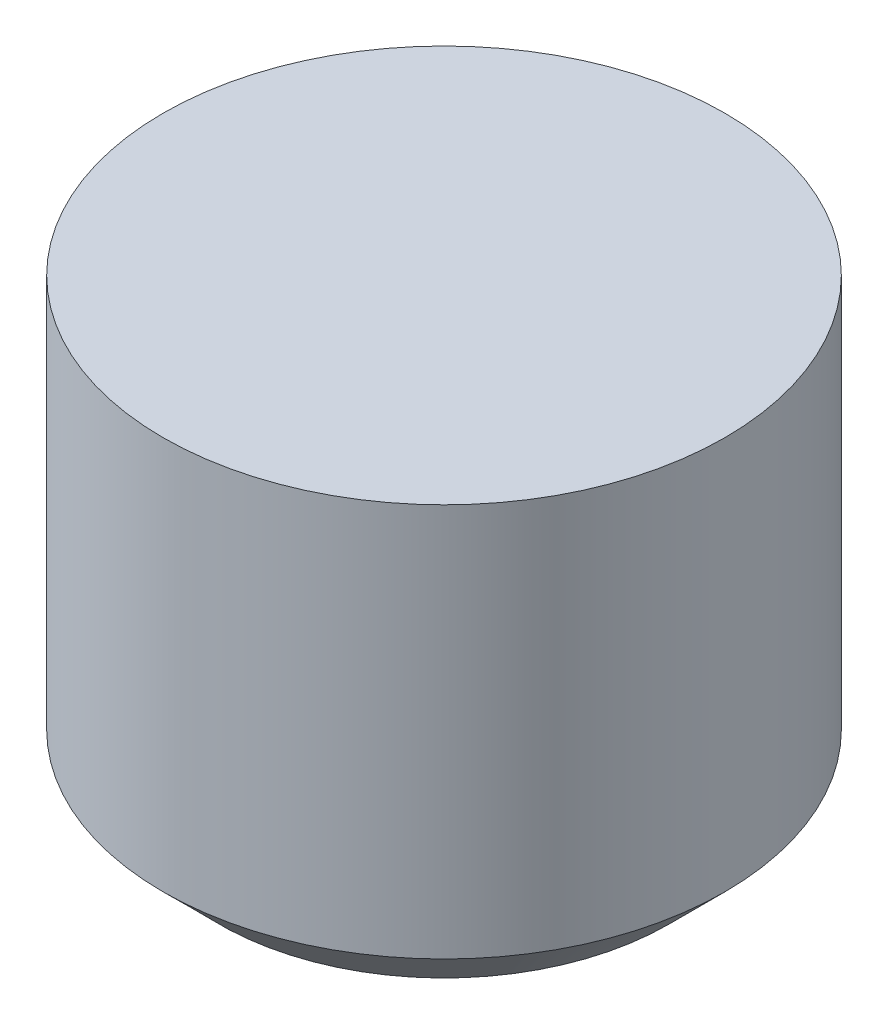
ISO-10303-21;
HEADER;
FILE_DESCRIPTION(('STEP AP214'),'2;1');
FILE_NAME('part.step','',(''),(''),'','','');
FILE_SCHEMA(('AUTOMOTIVE_DESIGN { 1 0 10303 214 1 1 1 1 }'));
ENDSEC;
DATA;
#1=APPLICATION_CONTEXT('core data for automotive mechanical design processes');
#2=APPLICATION_PROTOCOL_DEFINITION('international standard','automotive_design',2000,#1);
#3=PRODUCT_CONTEXT('',#1,'mechanical');
#4=PRODUCT('Part','Part','',(#3));
#5=PRODUCT_RELATED_PRODUCT_CATEGORY('part','',(#4));
#6=PRODUCT_DEFINITION_FORMATION('','',#4);
#7=PRODUCT_DEFINITION_CONTEXT('part definition',#1,'design');
#8=PRODUCT_DEFINITION('design','',#6,#7);
#9=PRODUCT_DEFINITION_SHAPE('','',#8);
#10=(LENGTH_UNIT() NAMED_UNIT(*) SI_UNIT(.MILLI.,.METRE.));
#11=(NAMED_UNIT(*) PLANE_ANGLE_UNIT() SI_UNIT($,.RADIAN.));
#12=(NAMED_UNIT(*) SI_UNIT($,.STERADIAN.) SOLID_ANGLE_UNIT());
#13=UNCERTAINTY_MEASURE_WITH_UNIT(LENGTH_MEASURE(1.E-05),#10,'distance_accuracy_value','');
#14=(GEOMETRIC_REPRESENTATION_CONTEXT(3) GLOBAL_UNCERTAINTY_ASSIGNED_CONTEXT((#13)) GLOBAL_UNIT_ASSIGNED_CONTEXT((#10,
#11,#12)) REPRESENTATION_CONTEXT('',''));
#15=CARTESIAN_POINT('',(0.,0.,0.));
#16=DIRECTION('',(0.,0.,1.));
#17=DIRECTION('',(1.,0.,0.));
#18=AXIS2_PLACEMENT_3D('',#15,#16,#17);
#19=CARTESIAN_POINT('',(0.,-2.,0.));
#20=DIRECTION('',(0.,1.,0.));
#21=DIRECTION('',(0.,0.,1.));
#22=AXIS2_PLACEMENT_3D('',#19,#20,#21);
#23=PLANE('',#22);
#24=CARTESIAN_POINT('',(0.,-1.99999999995271,0.));
#25=DIRECTION('',(0.,1.,0.));
#26=DIRECTION('',(-1.,0.,0.));
#27=AXIS2_PLACEMENT_3D('',#24,#25,#26);
#28=CIRCLE('',#27,2.00000000000955);
#29=CARTESIAN_POINT('',(-2.00000000000955,-1.99999999995271,0.));
#30=VERTEX_POINT('',#29);
#31=EDGE_CURVE('E17',#30,#30,#28,.T.);
#32=ORIENTED_EDGE('',*,*,#31,.F.);
#33=EDGE_LOOP('',(#32));
#34=FACE_BOUND('',#33,.T.);
#35=ADVANCED_FACE('F14',(#34),#23,.F.);
#36=CARTESIAN_POINT('',(0.,-1.50000000002137,0.));
#37=DIRECTION('',(0.,1.,0.));
#38=DIRECTION('',(-1.,0.,0.));
#39=AXIS2_PLACEMENT_3D('',#36,#37,#38);
#40=CONICAL_SURFACE('',#39,2.49999999994088,0.785398163397448);
#41=ORIENTED_EDGE('',*,*,#31,.T.);
#42=EDGE_LOOP('',(#41));
#43=FACE_BOUND('',#42,.T.);
#44=CARTESIAN_POINT('',(0.,-1.5,0.));
#45=DIRECTION('',(0.,-1.,0.));
#46=DIRECTION('',(0.,0.,-1.));
#47=AXIS2_PLACEMENT_3D('',#44,#45,#46);
#48=CIRCLE('',#47,2.5);
#49=CARTESIAN_POINT('',(0.,-1.5,-2.5));
#50=VERTEX_POINT('',#49);
#51=EDGE_CURVE('E21',#50,#50,#48,.F.);
#52=ORIENTED_EDGE('',*,*,#51,.F.);
#53=EDGE_LOOP('',(#52));
#54=FACE_BOUND('',#53,.T.);
#55=ADVANCED_FACE('F31',(#43,#54),#40,.T.);
#56=CARTESIAN_POINT('',(0.,2.,0.));
#57=DIRECTION('',(0.,1.,0.));
#58=DIRECTION('',(0.,0.,1.));
#59=AXIS2_PLACEMENT_3D('',#56,#57,#58);
#60=PLANE('',#59);
#61=CARTESIAN_POINT('',(0.,2.,0.));
#62=DIRECTION('',(0.,-1.,0.));
#63=DIRECTION('',(0.,0.,-1.));
#64=AXIS2_PLACEMENT_3D('',#61,#62,#63);
#65=CIRCLE('',#64,2.5);
#66=CARTESIAN_POINT('',(0.,2.,-2.5));
#67=VERTEX_POINT('',#66);
#68=EDGE_CURVE('E10',#67,#67,#65,.T.);
#69=ORIENTED_EDGE('',*,*,#68,.F.);
#70=EDGE_LOOP('',(#69));
#71=FACE_BOUND('',#70,.T.);
#72=ADVANCED_FACE('F39',(#71),#60,.T.);
#73=CARTESIAN_POINT('',(0.,2.,0.));
#74=DIRECTION('',(0.,-1.,0.));
#75=DIRECTION('',(0.,0.,-1.));
#76=AXIS2_PLACEMENT_3D('',#73,#74,#75);
#77=CYLINDRICAL_SURFACE('',#76,2.5);
#78=ORIENTED_EDGE('',*,*,#68,.T.);
#79=EDGE_LOOP('',(#78));
#80=FACE_BOUND('',#79,.T.);
#81=ORIENTED_EDGE('',*,*,#51,.T.);
#82=EDGE_LOOP('',(#81));
#83=FACE_BOUND('',#82,.T.);
#84=ADVANCED_FACE('F40',(#80,#83),#77,.T.);
#85=CLOSED_SHELL('',(#35,#55,#72,#84));
#86=MANIFOLD_SOLID_BREP('B1',#85);
#87=ADVANCED_BREP_SHAPE_REPRESENTATION('',(#18,#86),#14);
#88=SHAPE_DEFINITION_REPRESENTATION(#9,#87);
ENDSEC;
END-ISO-10303-21;
